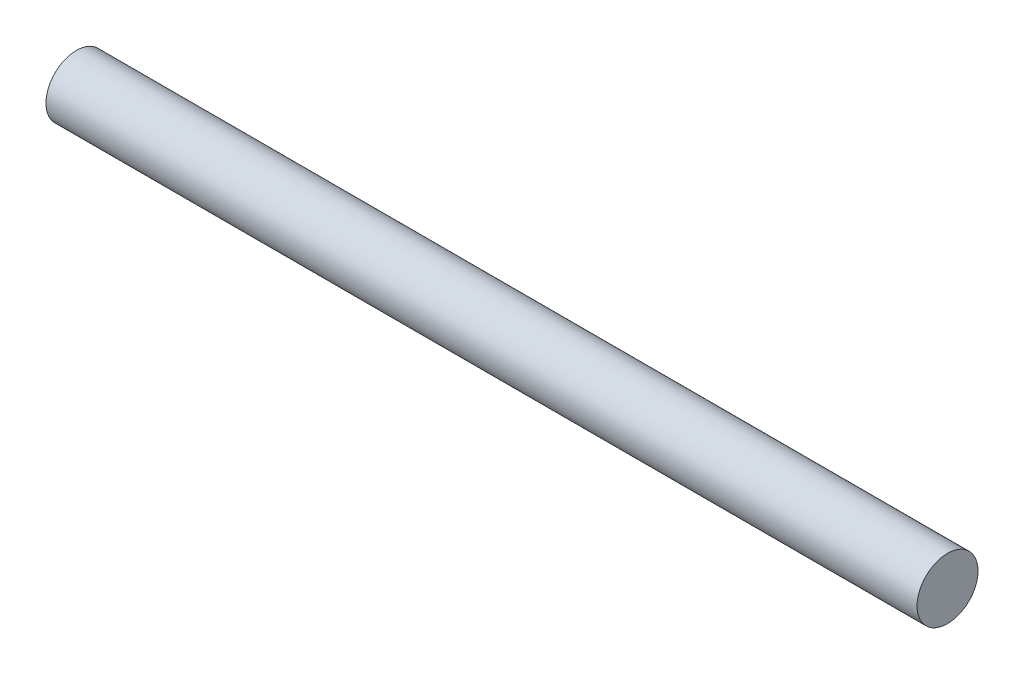
ISO-10303-21;
HEADER;
FILE_DESCRIPTION(('STEP AP214'),'2;1');
FILE_NAME('part.step','',(''),(''),'','','');
FILE_SCHEMA(('AUTOMOTIVE_DESIGN { 1 0 10303 214 1 1 1 1 }'));
ENDSEC;
DATA;
#1=APPLICATION_CONTEXT('core data for automotive mechanical design processes');
#2=APPLICATION_PROTOCOL_DEFINITION('international standard','automotive_design',2000,#1);
#3=PRODUCT_CONTEXT('',#1,'mechanical');
#4=PRODUCT('Part','Part','',(#3));
#5=PRODUCT_RELATED_PRODUCT_CATEGORY('part','',(#4));
#6=PRODUCT_DEFINITION_FORMATION('','',#4);
#7=PRODUCT_DEFINITION_CONTEXT('part definition',#1,'design');
#8=PRODUCT_DEFINITION('design','',#6,#7);
#9=PRODUCT_DEFINITION_SHAPE('','',#8);
#10=(LENGTH_UNIT() NAMED_UNIT(*) SI_UNIT(.MILLI.,.METRE.));
#11=(NAMED_UNIT(*) PLANE_ANGLE_UNIT() SI_UNIT($,.RADIAN.));
#12=(NAMED_UNIT(*) SI_UNIT($,.STERADIAN.) SOLID_ANGLE_UNIT());
#13=UNCERTAINTY_MEASURE_WITH_UNIT(LENGTH_MEASURE(1.E-05),#10,'distance_accuracy_value','');
#14=(GEOMETRIC_REPRESENTATION_CONTEXT(3) GLOBAL_UNCERTAINTY_ASSIGNED_CONTEXT((#13)) GLOBAL_UNIT_ASSIGNED_CONTEXT((#10,
#11,#12)) REPRESENTATION_CONTEXT('',''));
#15=CARTESIAN_POINT('',(0.,0.,0.));
#16=DIRECTION('',(0.,0.,1.));
#17=DIRECTION('',(1.,0.,0.));
#18=AXIS2_PLACEMENT_3D('',#15,#16,#17);
#19=CARTESIAN_POINT('',(250.,0.,0.));
#20=DIRECTION('',(-1.,0.,0.));
#21=DIRECTION('',(0.,0.,1.));
#22=AXIS2_PLACEMENT_3D('',#19,#20,#21);
#23=CYLINDRICAL_SURFACE('',#22,17.5);
#24=CARTESIAN_POINT('',(250.,0.,0.));
#25=DIRECTION('',(1.,0.,0.));
#26=DIRECTION('',(0.,0.,-1.));
#27=AXIS2_PLACEMENT_3D('',#24,#25,#26);
#28=CIRCLE('',#27,17.5);
#29=CARTESIAN_POINT('',(250.,0.,-17.5));
#30=VERTEX_POINT('',#29);
#31=EDGE_CURVE('E10',#30,#30,#28,.T.);
#32=ORIENTED_EDGE('',*,*,#31,.F.);
#33=EDGE_LOOP('',(#32));
#34=FACE_BOUND('',#33,.T.);
#35=CARTESIAN_POINT('',(-250.,0.,0.));
#36=DIRECTION('',(1.,0.,0.));
#37=DIRECTION('',(0.,0.,-1.));
#38=AXIS2_PLACEMENT_3D('',#35,#36,#37);
#39=CIRCLE('',#38,17.5);
#40=CARTESIAN_POINT('',(-250.,0.,-17.5));
#41=VERTEX_POINT('',#40);
#42=EDGE_CURVE('E34',#41,#41,#39,.T.);
#43=ORIENTED_EDGE('',*,*,#42,.T.);
#44=EDGE_LOOP('',(#43));
#45=FACE_BOUND('',#44,.T.);
#46=ADVANCED_FACE('F31',(#34,#45),#23,.T.);
#47=CARTESIAN_POINT('',(250.,0.,0.));
#48=DIRECTION('',(1.,0.,0.));
#49=DIRECTION('',(0.,0.,-1.));
#50=AXIS2_PLACEMENT_3D('',#47,#48,#49);
#51=PLANE('',#50);
#52=ORIENTED_EDGE('',*,*,#31,.T.);
#53=EDGE_LOOP('',(#52));
#54=FACE_BOUND('',#53,.T.);
#55=ADVANCED_FACE('F46',(#54),#51,.T.);
#56=CARTESIAN_POINT('',(-250.,0.,0.));
#57=DIRECTION('',(1.,0.,0.));
#58=DIRECTION('',(0.,0.,-1.));
#59=AXIS2_PLACEMENT_3D('',#56,#57,#58);
#60=PLANE('',#59);
#61=ORIENTED_EDGE('',*,*,#42,.F.);
#62=EDGE_LOOP('',(#61));
#63=FACE_BOUND('',#62,.T.);
#64=ADVANCED_FACE('F44',(#63),#60,.F.);
#65=CLOSED_SHELL('',(#46,#55,#64));
#66=MANIFOLD_SOLID_BREP('B2',#65);
#67=ADVANCED_BREP_SHAPE_REPRESENTATION('',(#18,#66),#14);
#68=SHAPE_DEFINITION_REPRESENTATION(#9,#67);
ENDSEC;
END-ISO-10303-21;
